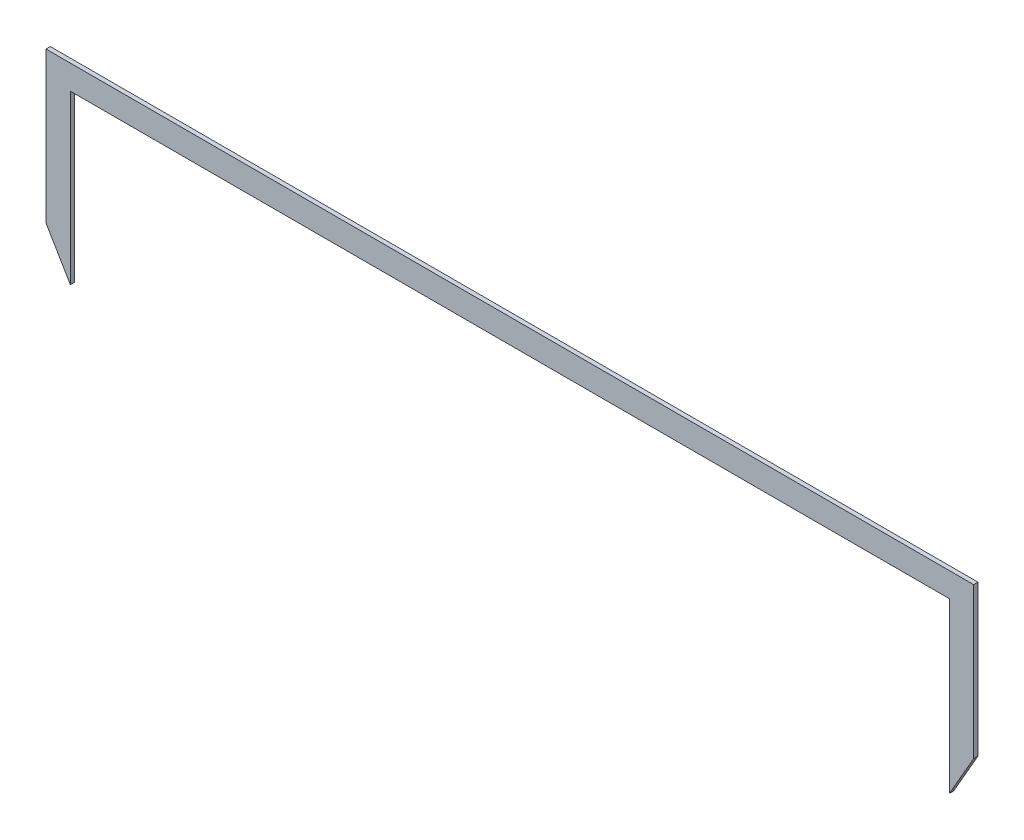
ISO-10303-21;
HEADER;
FILE_DESCRIPTION(('STEP AP214'),'2;1');
FILE_NAME('part.step','',(''),(''),'','','');
FILE_SCHEMA(('AUTOMOTIVE_DESIGN { 1 0 10303 214 1 1 1 1 }'));
ENDSEC;
DATA;
#1=APPLICATION_CONTEXT('core data for automotive mechanical design processes');
#2=APPLICATION_PROTOCOL_DEFINITION('international standard','automotive_design',2000,#1);
#3=PRODUCT_CONTEXT('',#1,'mechanical');
#4=PRODUCT('Part','Part','',(#3));
#5=PRODUCT_RELATED_PRODUCT_CATEGORY('part','',(#4));
#6=PRODUCT_DEFINITION_FORMATION('','',#4);
#7=PRODUCT_DEFINITION_CONTEXT('part definition',#1,'design');
#8=PRODUCT_DEFINITION('design','',#6,#7);
#9=PRODUCT_DEFINITION_SHAPE('','',#8);
#10=(LENGTH_UNIT() NAMED_UNIT(*) SI_UNIT(.MILLI.,.METRE.));
#11=(NAMED_UNIT(*) PLANE_ANGLE_UNIT() SI_UNIT($,.RADIAN.));
#12=(NAMED_UNIT(*) SI_UNIT($,.STERADIAN.) SOLID_ANGLE_UNIT());
#13=UNCERTAINTY_MEASURE_WITH_UNIT(LENGTH_MEASURE(1.E-05),#10,'distance_accuracy_value','');
#14=(GEOMETRIC_REPRESENTATION_CONTEXT(3) GLOBAL_UNCERTAINTY_ASSIGNED_CONTEXT((#13)) GLOBAL_UNIT_ASSIGNED_CONTEXT((#10,
#11,#12)) REPRESENTATION_CONTEXT('',''));
#15=CARTESIAN_POINT('',(0.,0.,0.));
#16=DIRECTION('',(0.,0.,1.));
#17=DIRECTION('',(1.,0.,0.));
#18=AXIS2_PLACEMENT_3D('',#15,#16,#17);
#19=CARTESIAN_POINT('',(-861.468217561385,395.374747166262,3.));
#20=DIRECTION('',(1.,0.,0.));
#21=DIRECTION('',(0.,1.,0.));
#22=AXIS2_PLACEMENT_3D('',#19,#20,#21);
#23=PLANE('',#22);
#24=DIRECTION('',(0.,-1.,0.));
#25=VECTOR('',#24,1.);
#26=CARTESIAN_POINT('',(-861.468217561385,395.374747166262,0.));
#27=LINE('',#26,#25);
#28=CARTESIAN_POINT('',(-861.468217561385,500.606896828066,0.));
#29=VERTEX_POINT('',#28);
#30=CARTESIAN_POINT('',(-861.468217561385,395.374747166262,0.));
#31=VERTEX_POINT('',#30);
#32=EDGE_CURVE('E135',#29,#31,#27,.T.);
#33=ORIENTED_EDGE('',*,*,#32,.T.);
#34=DIRECTION('',(0.,0.,-1.));
#35=VECTOR('',#34,1.);
#36=CARTESIAN_POINT('',(-861.468217561385,395.374747166262,3.));
#37=LINE('',#36,#35);
#38=CARTESIAN_POINT('',(-861.468217561385,395.374747166262,3.));
#39=VERTEX_POINT('',#38);
#40=EDGE_CURVE('E11',#39,#31,#37,.T.);
#41=ORIENTED_EDGE('',*,*,#40,.F.);
#42=DIRECTION('',(0.,-1.,0.));
#43=VECTOR('',#42,1.);
#44=CARTESIAN_POINT('',(-861.468217561385,395.374747166262,3.));
#45=LINE('',#44,#43);
#46=CARTESIAN_POINT('',(-861.468217561385,500.606896828066,3.));
#47=VERTEX_POINT('',#46);
#48=EDGE_CURVE('E149',#47,#39,#45,.T.);
#49=ORIENTED_EDGE('',*,*,#48,.F.);
#50=DIRECTION('',(0.,0.,-1.));
#51=VECTOR('',#50,1.);
#52=CARTESIAN_POINT('',(-861.468217561385,500.606896828066,3.));
#53=LINE('',#52,#51);
#54=EDGE_CURVE('E131',#47,#29,#53,.T.);
#55=ORIENTED_EDGE('',*,*,#54,.T.);
#56=EDGE_LOOP('',(#33,#41,#49,#55));
#57=FACE_BOUND('',#56,.T.);
#58=ADVANCED_FACE('F39',(#57),#23,.F.);
#59=CARTESIAN_POINT('',(-844.46953235542,366.54267036548,3.));
#60=DIRECTION('',(0.861429266017735,0.507877563639255,0.));
#61=DIRECTION('',(-0.507877563639255,0.861429266017736,0.));
#62=AXIS2_PLACEMENT_3D('',#59,#60,#61);
#63=PLANE('',#62);
#64=DIRECTION('',(0.507877563639255,-0.861429266017736,0.));
#65=VECTOR('',#64,1.);
#66=CARTESIAN_POINT('',(-844.46953235542,366.54267036548,0.));
#67=LINE('',#66,#65);
#68=CARTESIAN_POINT('',(-844.46953235542,366.54267036548,0.));
#69=VERTEX_POINT('',#68);
#70=EDGE_CURVE('E138',#31,#69,#67,.T.);
#71=ORIENTED_EDGE('',*,*,#70,.T.);
#72=DIRECTION('',(0.,0.,-1.));
#73=VECTOR('',#72,1.);
#74=CARTESIAN_POINT('',(-844.46953235542,366.54267036548,3.));
#75=LINE('',#74,#73);
#76=CARTESIAN_POINT('',(-844.46953235542,366.54267036548,3.));
#77=VERTEX_POINT('',#76);
#78=EDGE_CURVE('E47',#77,#69,#75,.T.);
#79=ORIENTED_EDGE('',*,*,#78,.F.);
#80=DIRECTION('',(0.507877563639255,-0.861429266017736,0.));
#81=VECTOR('',#80,1.);
#82=CARTESIAN_POINT('',(-844.46953235542,366.54267036548,3.));
#83=LINE('',#82,#81);
#84=EDGE_CURVE('E98',#39,#77,#83,.T.);
#85=ORIENTED_EDGE('',*,*,#84,.F.);
#86=ORIENTED_EDGE('',*,*,#40,.T.);
#87=EDGE_LOOP('',(#71,#79,#85,#86));
#88=FACE_BOUND('',#87,.T.);
#89=ADVANCED_FACE('F184',(#88),#63,.F.);
#90=CARTESIAN_POINT('',(-844.46953235542,483.608211622101,3.));
#91=DIRECTION('',(-1.,0.,0.));
#92=DIRECTION('',(0.,-1.,0.));
#93=AXIS2_PLACEMENT_3D('',#90,#91,#92);
#94=PLANE('',#93);
#95=DIRECTION('',(0.,1.,0.));
#96=VECTOR('',#95,1.);
#97=CARTESIAN_POINT('',(-844.46953235542,483.608211622101,0.));
#98=LINE('',#97,#96);
#99=CARTESIAN_POINT('',(-844.46953235542,483.608211622101,0.));
#100=VERTEX_POINT('',#99);
#101=EDGE_CURVE('E140',#69,#100,#98,.T.);
#102=ORIENTED_EDGE('',*,*,#101,.T.);
#103=DIRECTION('',(0.,0.,-1.));
#104=VECTOR('',#103,1.);
#105=CARTESIAN_POINT('',(-844.46953235542,483.608211622101,3.));
#106=LINE('',#105,#104);
#107=CARTESIAN_POINT('',(-844.46953235542,483.608211622101,3.));
#108=VERTEX_POINT('',#107);
#109=EDGE_CURVE('E156',#108,#100,#106,.T.);
#110=ORIENTED_EDGE('',*,*,#109,.F.);
#111=DIRECTION('',(0.,1.,0.));
#112=VECTOR('',#111,1.);
#113=CARTESIAN_POINT('',(-844.46953235542,483.608211622101,3.));
#114=LINE('',#113,#112);
#115=EDGE_CURVE('E164',#77,#108,#114,.T.);
#116=ORIENTED_EDGE('',*,*,#115,.F.);
#117=ORIENTED_EDGE('',*,*,#78,.T.);
#118=EDGE_LOOP('',(#102,#110,#116,#117));
#119=FACE_BOUND('',#118,.T.);
#120=ADVANCED_FACE('F162',(#119),#94,.F.);
#121=CARTESIAN_POINT('',(-230.466465747933,483.608211622101,3.));
#122=DIRECTION('',(0.,1.,0.));
#123=DIRECTION('',(0.,0.,1.));
#124=AXIS2_PLACEMENT_3D('',#121,#122,#123);
#125=PLANE('',#124);
#126=DIRECTION('',(1.,0.,0.));
#127=VECTOR('',#126,1.);
#128=CARTESIAN_POINT('',(-230.466465747933,483.608211622101,0.));
#129=LINE('',#128,#127);
#130=CARTESIAN_POINT('',(-230.466465747933,483.608211622101,0.));
#131=VERTEX_POINT('',#130);
#132=EDGE_CURVE('E142',#100,#131,#129,.T.);
#133=ORIENTED_EDGE('',*,*,#132,.T.);
#134=DIRECTION('',(0.,0.,-1.));
#135=VECTOR('',#134,1.);
#136=CARTESIAN_POINT('',(-230.466465747933,483.608211622101,3.));
#137=LINE('',#136,#135);
#138=CARTESIAN_POINT('',(-230.466465747933,483.608211622101,3.));
#139=VERTEX_POINT('',#138);
#140=EDGE_CURVE('E153',#139,#131,#137,.T.);
#141=ORIENTED_EDGE('',*,*,#140,.F.);
#142=DIRECTION('',(1.,0.,0.));
#143=VECTOR('',#142,1.);
#144=CARTESIAN_POINT('',(-230.466465747933,483.608211622101,3.));
#145=LINE('',#144,#143);
#146=EDGE_CURVE('E176',#108,#139,#145,.T.);
#147=ORIENTED_EDGE('',*,*,#146,.F.);
#148=ORIENTED_EDGE('',*,*,#109,.T.);
#149=EDGE_LOOP('',(#133,#141,#147,#148));
#150=FACE_BOUND('',#149,.T.);
#151=ADVANCED_FACE('F172',(#150),#125,.F.);
#152=CARTESIAN_POINT('',(-230.466465747933,365.786721753349,3.));
#153=DIRECTION('',(1.,0.,0.));
#154=DIRECTION('',(0.,0.,-1.));
#155=AXIS2_PLACEMENT_3D('',#152,#153,#154);
#156=PLANE('',#155);
#157=DIRECTION('',(0.,-1.,0.));
#158=VECTOR('',#157,1.);
#159=CARTESIAN_POINT('',(-230.466465747933,365.786721753349,0.));
#160=LINE('',#159,#158);
#161=CARTESIAN_POINT('',(-230.466465747933,365.786721753349,0.));
#162=VERTEX_POINT('',#161);
#163=EDGE_CURVE('E144',#131,#162,#160,.T.);
#164=ORIENTED_EDGE('',*,*,#163,.T.);
#165=DIRECTION('',(0.,0.,-1.));
#166=VECTOR('',#165,1.);
#167=CARTESIAN_POINT('',(-230.466465747933,365.786721753349,3.));
#168=LINE('',#167,#166);
#169=CARTESIAN_POINT('',(-230.466465747933,365.786721753349,3.));
#170=VERTEX_POINT('',#169);
#171=EDGE_CURVE('E126',#170,#162,#168,.T.);
#172=ORIENTED_EDGE('',*,*,#171,.F.);
#173=DIRECTION('',(0.,-1.,0.));
#174=VECTOR('',#173,1.);
#175=CARTESIAN_POINT('',(-230.466465747933,365.786721753349,3.));
#176=LINE('',#175,#174);
#177=EDGE_CURVE('E117',#139,#170,#176,.T.);
#178=ORIENTED_EDGE('',*,*,#177,.F.);
#179=ORIENTED_EDGE('',*,*,#140,.T.);
#180=EDGE_LOOP('',(#164,#172,#178,#179));
#181=FACE_BOUND('',#180,.T.);
#182=ADVANCED_FACE('F175',(#181),#156,.F.);
#183=CARTESIAN_POINT('',(-213.467780541968,395.374747166262,3.));
#184=DIRECTION('',(-0.867088974161715,0.498153300588469,0.));
#185=DIRECTION('',(-0.498153300588469,-0.867088974161715,0.));
#186=AXIS2_PLACEMENT_3D('',#183,#184,#185);
#187=PLANE('',#186);
#188=DIRECTION('',(0.498153300588469,0.867088974161714,0.));
#189=VECTOR('',#188,1.);
#190=CARTESIAN_POINT('',(-213.467780541968,395.374747166262,0.));
#191=LINE('',#190,#189);
#192=CARTESIAN_POINT('',(-213.467780541968,395.374747166262,0.));
#193=VERTEX_POINT('',#192);
#194=EDGE_CURVE('E125',#162,#193,#191,.T.);
#195=ORIENTED_EDGE('',*,*,#194,.T.);
#196=DIRECTION('',(0.,0.,-1.));
#197=VECTOR('',#196,1.);
#198=CARTESIAN_POINT('',(-213.467780541968,395.374747166262,3.));
#199=LINE('',#198,#197);
#200=CARTESIAN_POINT('',(-213.467780541968,395.374747166262,3.));
#201=VERTEX_POINT('',#200);
#202=EDGE_CURVE('E122',#201,#193,#199,.T.);
#203=ORIENTED_EDGE('',*,*,#202,.F.);
#204=DIRECTION('',(0.498153300588469,0.867088974161714,0.));
#205=VECTOR('',#204,1.);
#206=CARTESIAN_POINT('',(-213.467780541968,395.374747166262,3.));
#207=LINE('',#206,#205);
#208=EDGE_CURVE('E111',#170,#201,#207,.T.);
#209=ORIENTED_EDGE('',*,*,#208,.F.);
#210=ORIENTED_EDGE('',*,*,#171,.T.);
#211=EDGE_LOOP('',(#195,#203,#209,#210));
#212=FACE_BOUND('',#211,.T.);
#213=ADVANCED_FACE('F123',(#212),#187,.F.);
#214=CARTESIAN_POINT('',(-213.467780541968,395.374747166262,3.));
#215=DIRECTION('',(-1.,0.,0.));
#216=DIRECTION('',(0.,0.,1.));
#217=AXIS2_PLACEMENT_3D('',#214,#215,#216);
#218=PLANE('',#217);
#219=DIRECTION('',(0.,1.,0.));
#220=VECTOR('',#219,1.);
#221=CARTESIAN_POINT('',(-213.467780541968,395.374747166262,0.));
#222=LINE('',#221,#220);
#223=CARTESIAN_POINT('',(-213.467780541968,500.606896828066,0.));
#224=VERTEX_POINT('',#223);
#225=EDGE_CURVE('E84',#193,#224,#222,.T.);
#226=ORIENTED_EDGE('',*,*,#225,.T.);
#227=DIRECTION('',(0.,0.,-1.));
#228=VECTOR('',#227,1.);
#229=CARTESIAN_POINT('',(-213.467780541968,500.606896828066,3.));
#230=LINE('',#229,#228);
#231=CARTESIAN_POINT('',(-213.467780541968,500.606896828066,3.));
#232=VERTEX_POINT('',#231);
#233=EDGE_CURVE('E127',#232,#224,#230,.T.);
#234=ORIENTED_EDGE('',*,*,#233,.F.);
#235=DIRECTION('',(0.,1.,0.));
#236=VECTOR('',#235,1.);
#237=CARTESIAN_POINT('',(-213.467780541968,395.374747166262,3.));
#238=LINE('',#237,#236);
#239=EDGE_CURVE('E115',#201,#232,#238,.T.);
#240=ORIENTED_EDGE('',*,*,#239,.F.);
#241=ORIENTED_EDGE('',*,*,#202,.T.);
#242=EDGE_LOOP('',(#226,#234,#240,#241));
#243=FACE_BOUND('',#242,.T.);
#244=ADVANCED_FACE('F129',(#243),#218,.F.);
#245=CARTESIAN_POINT('',(-861.468217561385,500.606896828066,3.));
#246=DIRECTION('',(0.,-1.,0.));
#247=DIRECTION('',(0.,0.,-1.));
#248=AXIS2_PLACEMENT_3D('',#245,#246,#247);
#249=PLANE('',#248);
#250=DIRECTION('',(-1.,0.,0.));
#251=VECTOR('',#250,1.);
#252=CARTESIAN_POINT('',(-861.468217561385,500.606896828066,0.));
#253=LINE('',#252,#251);
#254=EDGE_CURVE('E90',#224,#29,#253,.T.);
#255=ORIENTED_EDGE('',*,*,#254,.T.);
#256=ORIENTED_EDGE('',*,*,#54,.F.);
#257=DIRECTION('',(-1.,0.,0.));
#258=VECTOR('',#257,1.);
#259=CARTESIAN_POINT('',(-861.468217561385,500.606896828066,3.));
#260=LINE('',#259,#258);
#261=EDGE_CURVE('E55',#232,#47,#260,.T.);
#262=ORIENTED_EDGE('',*,*,#261,.F.);
#263=ORIENTED_EDGE('',*,*,#233,.T.);
#264=EDGE_LOOP('',(#255,#256,#262,#263));
#265=FACE_BOUND('',#264,.T.);
#266=ADVANCED_FACE('F200',(#265),#249,.F.);
#267=CARTESIAN_POINT('',(0.,0.,3.));
#268=DIRECTION('',(0.,0.,-1.));
#269=DIRECTION('',(-1.,0.,0.));
#270=AXIS2_PLACEMENT_3D('',#267,#268,#269);
#271=PLANE('',#270);
#272=ORIENTED_EDGE('',*,*,#48,.T.);
#273=ORIENTED_EDGE('',*,*,#84,.T.);
#274=ORIENTED_EDGE('',*,*,#115,.T.);
#275=ORIENTED_EDGE('',*,*,#146,.T.);
#276=ORIENTED_EDGE('',*,*,#177,.T.);
#277=ORIENTED_EDGE('',*,*,#208,.T.);
#278=ORIENTED_EDGE('',*,*,#239,.T.);
#279=ORIENTED_EDGE('',*,*,#261,.T.);
#280=EDGE_LOOP('',(#272,#273,#274,#275,#276,#277,#278,#279));
#281=FACE_BOUND('',#280,.T.);
#282=ADVANCED_FACE('F113',(#281),#271,.F.);
#283=CARTESIAN_POINT('',(0.,0.,0.));
#284=DIRECTION('',(0.,0.,-1.));
#285=DIRECTION('',(-1.,0.,0.));
#286=AXIS2_PLACEMENT_3D('',#283,#284,#285);
#287=PLANE('',#286);
#288=ORIENTED_EDGE('',*,*,#32,.F.);
#289=ORIENTED_EDGE('',*,*,#254,.F.);
#290=ORIENTED_EDGE('',*,*,#225,.F.);
#291=ORIENTED_EDGE('',*,*,#194,.F.);
#292=ORIENTED_EDGE('',*,*,#163,.F.);
#293=ORIENTED_EDGE('',*,*,#132,.F.);
#294=ORIENTED_EDGE('',*,*,#101,.F.);
#295=ORIENTED_EDGE('',*,*,#70,.F.);
#296=EDGE_LOOP('',(#288,#289,#290,#291,#292,#293,#294,#295));
#297=FACE_BOUND('',#296,.T.);
#298=ADVANCED_FACE('F168',(#297),#287,.T.);
#299=CLOSED_SHELL('',(#58,#89,#120,#151,#182,#213,#244,#266,#282,#298));
#300=MANIFOLD_SOLID_BREP('B2',#299);
#301=ADVANCED_BREP_SHAPE_REPRESENTATION('',(#18,#300),#14);
#302=SHAPE_DEFINITION_REPRESENTATION(#9,#301);
ENDSEC;
END-ISO-10303-21;
